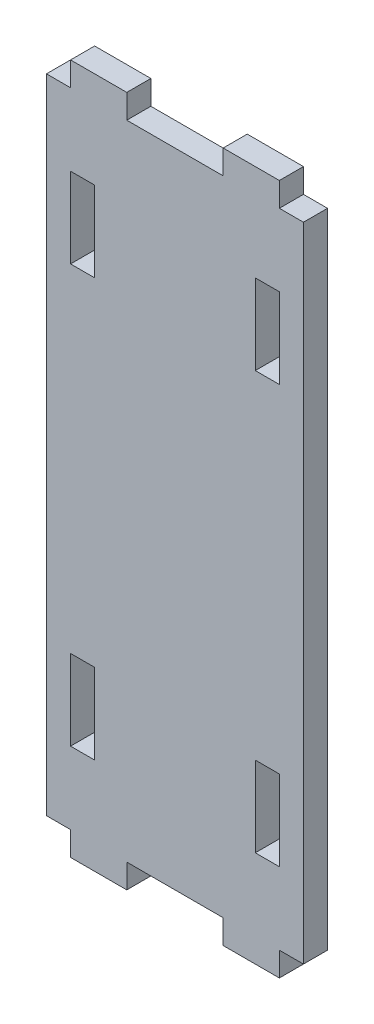
ISO-10303-21;
HEADER;
FILE_DESCRIPTION(('STEP AP214'),'2;1');
FILE_NAME('part.step','',(''),(''),'','','');
FILE_SCHEMA(('AUTOMOTIVE_DESIGN { 1 0 10303 214 1 1 1 1 }'));
ENDSEC;
DATA;
#1=APPLICATION_CONTEXT('core data for automotive mechanical design processes');
#2=APPLICATION_PROTOCOL_DEFINITION('international standard','automotive_design',2000,#1);
#3=PRODUCT_CONTEXT('',#1,'mechanical');
#4=PRODUCT('Part','Part','',(#3));
#5=PRODUCT_RELATED_PRODUCT_CATEGORY('part','',(#4));
#6=PRODUCT_DEFINITION_FORMATION('','',#4);
#7=PRODUCT_DEFINITION_CONTEXT('part definition',#1,'design');
#8=PRODUCT_DEFINITION('design','',#6,#7);
#9=PRODUCT_DEFINITION_SHAPE('','',#8);
#10=(LENGTH_UNIT() NAMED_UNIT(*) SI_UNIT(.MILLI.,.METRE.));
#11=(NAMED_UNIT(*) PLANE_ANGLE_UNIT() SI_UNIT($,.RADIAN.));
#12=(NAMED_UNIT(*) SI_UNIT($,.STERADIAN.) SOLID_ANGLE_UNIT());
#13=UNCERTAINTY_MEASURE_WITH_UNIT(LENGTH_MEASURE(1.E-05),#10,'distance_accuracy_value','');
#14=(GEOMETRIC_REPRESENTATION_CONTEXT(3) GLOBAL_UNCERTAINTY_ASSIGNED_CONTEXT((#13)) GLOBAL_UNIT_ASSIGNED_CONTEXT((#10,
#11,#12)) REPRESENTATION_CONTEXT('',''));
#15=CARTESIAN_POINT('',(0.,0.,0.));
#16=DIRECTION('',(0.,0.,1.));
#17=DIRECTION('',(1.,0.,0.));
#18=AXIS2_PLACEMENT_3D('',#15,#16,#17);
#19=CARTESIAN_POINT('',(0.,0.,3.));
#20=DIRECTION('',(1.,0.,0.));
#21=DIRECTION('',(0.,0.,-1.));
#22=AXIS2_PLACEMENT_3D('',#19,#20,#21);
#23=PLANE('',#22);
#24=DIRECTION('',(0.,-1.,0.));
#25=VECTOR('',#24,1.);
#26=CARTESIAN_POINT('',(0.,0.,3.));
#27=LINE('',#26,#25);
#28=CARTESIAN_POINT('',(0.,83.,3.));
#29=VERTEX_POINT('',#28);
#30=CARTESIAN_POINT('',(0.,3.,3.));
#31=VERTEX_POINT('',#30);
#32=EDGE_CURVE('E522',#29,#31,#27,.T.);
#33=ORIENTED_EDGE('',*,*,#32,.F.);
#34=DIRECTION('',(0.,0.,1.));
#35=VECTOR('',#34,1.);
#36=CARTESIAN_POINT('',(0.,83.,0.));
#37=LINE('',#36,#35);
#38=CARTESIAN_POINT('',(0.,83.,0.));
#39=VERTEX_POINT('',#38);
#40=EDGE_CURVE('E428',#39,#29,#37,.T.);
#41=ORIENTED_EDGE('',*,*,#40,.F.);
#42=DIRECTION('',(0.,-1.,0.));
#43=VECTOR('',#42,1.);
#44=CARTESIAN_POINT('',(0.,0.,0.));
#45=LINE('',#44,#43);
#46=CARTESIAN_POINT('',(0.,3.,0.));
#47=VERTEX_POINT('',#46);
#48=EDGE_CURVE('E515',#39,#47,#45,.T.);
#49=ORIENTED_EDGE('',*,*,#48,.T.);
#50=DIRECTION('',(0.,0.,1.));
#51=VECTOR('',#50,1.);
#52=CARTESIAN_POINT('',(0.,3.,0.));
#53=LINE('',#52,#51);
#54=EDGE_CURVE('E493',#47,#31,#53,.T.);
#55=ORIENTED_EDGE('',*,*,#54,.T.);
#56=EDGE_LOOP('',(#33,#41,#49,#55));
#57=FACE_BOUND('',#56,.T.);
#58=ADVANCED_FACE('F34',(#57),#23,.F.);
#59=CARTESIAN_POINT('',(0.,0.,3.));
#60=DIRECTION('',(0.,1.,0.));
#61=DIRECTION('',(0.,0.,1.));
#62=AXIS2_PLACEMENT_3D('',#59,#60,#61);
#63=PLANE('',#62);
#64=DIRECTION('',(0.,0.,1.));
#65=VECTOR('',#64,1.);
#66=CARTESIAN_POINT('',(22.,0.,0.));
#67=LINE('',#66,#65);
#68=CARTESIAN_POINT('',(22.,0.,0.));
#69=VERTEX_POINT('',#68);
#70=CARTESIAN_POINT('',(22.,0.,3.));
#71=VERTEX_POINT('',#70);
#72=EDGE_CURVE('E451',#69,#71,#67,.T.);
#73=ORIENTED_EDGE('',*,*,#72,.F.);
#74=DIRECTION('',(1.,0.,0.));
#75=VECTOR('',#74,1.);
#76=CARTESIAN_POINT('',(0.,0.,0.));
#77=LINE('',#76,#75);
#78=CARTESIAN_POINT('',(29.,0.,0.));
#79=VERTEX_POINT('',#78);
#80=EDGE_CURVE('E536',#69,#79,#77,.T.);
#81=ORIENTED_EDGE('',*,*,#80,.T.);
#82=DIRECTION('',(0.,0.,1.));
#83=VECTOR('',#82,1.);
#84=CARTESIAN_POINT('',(29.,0.,0.));
#85=LINE('',#84,#83);
#86=CARTESIAN_POINT('',(29.,0.,3.));
#87=VERTEX_POINT('',#86);
#88=EDGE_CURVE('E417',#79,#87,#85,.T.);
#89=ORIENTED_EDGE('',*,*,#88,.T.);
#90=DIRECTION('',(1.,0.,0.));
#91=VECTOR('',#90,1.);
#92=CARTESIAN_POINT('',(0.,0.,3.));
#93=LINE('',#92,#91);
#94=EDGE_CURVE('E525',#71,#87,#93,.T.);
#95=ORIENTED_EDGE('',*,*,#94,.F.);
#96=EDGE_LOOP('',(#73,#81,#89,#95));
#97=FACE_BOUND('',#96,.T.);
#98=ADVANCED_FACE('F630',(#97),#63,.F.);
#99=CARTESIAN_POINT('',(3.,0.,0.));
#100=VERTEX_POINT('',#99);
#101=CARTESIAN_POINT('',(10.,0.,0.));
#102=VERTEX_POINT('',#101);
#103=EDGE_CURVE('E538',#100,#102,#77,.T.);
#104=ORIENTED_EDGE('',*,*,#103,.T.);
#105=DIRECTION('',(0.,0.,1.));
#106=VECTOR('',#105,1.);
#107=CARTESIAN_POINT('',(10.,0.,0.));
#108=LINE('',#107,#106);
#109=CARTESIAN_POINT('',(10.,0.,3.));
#110=VERTEX_POINT('',#109);
#111=EDGE_CURVE('E476',#102,#110,#108,.T.);
#112=ORIENTED_EDGE('',*,*,#111,.T.);
#113=CARTESIAN_POINT('',(3.,0.,3.));
#114=VERTEX_POINT('',#113);
#115=EDGE_CURVE('E529',#114,#110,#93,.T.);
#116=ORIENTED_EDGE('',*,*,#115,.F.);
#117=DIRECTION('',(0.,0.,1.));
#118=VECTOR('',#117,1.);
#119=CARTESIAN_POINT('',(3.,0.,0.));
#120=LINE('',#119,#118);
#121=EDGE_CURVE('E471',#100,#114,#120,.T.);
#122=ORIENTED_EDGE('',*,*,#121,.F.);
#123=EDGE_LOOP('',(#104,#112,#116,#122));
#124=FACE_BOUND('',#123,.T.);
#125=ADVANCED_FACE('F549',(#124),#63,.F.);
#126=CARTESIAN_POINT('',(32.,0.,3.));
#127=DIRECTION('',(-1.,0.,0.));
#128=DIRECTION('',(0.,0.,1.));
#129=AXIS2_PLACEMENT_3D('',#126,#127,#128);
#130=PLANE('',#129);
#131=DIRECTION('',(0.,1.,0.));
#132=VECTOR('',#131,1.);
#133=CARTESIAN_POINT('',(32.,0.,0.));
#134=LINE('',#133,#132);
#135=CARTESIAN_POINT('',(32.,3.,0.));
#136=VERTEX_POINT('',#135);
#137=CARTESIAN_POINT('',(32.,83.,0.));
#138=VERTEX_POINT('',#137);
#139=EDGE_CURVE('E539',#136,#138,#134,.T.);
#140=ORIENTED_EDGE('',*,*,#139,.T.);
#141=DIRECTION('',(0.,0.,1.));
#142=VECTOR('',#141,1.);
#143=CARTESIAN_POINT('',(32.,83.,0.));
#144=LINE('',#143,#142);
#145=CARTESIAN_POINT('',(32.,83.,3.));
#146=VERTEX_POINT('',#145);
#147=EDGE_CURVE('E454',#138,#146,#144,.T.);
#148=ORIENTED_EDGE('',*,*,#147,.T.);
#149=DIRECTION('',(0.,1.,0.));
#150=VECTOR('',#149,1.);
#151=CARTESIAN_POINT('',(32.,0.,3.));
#152=LINE('',#151,#150);
#153=CARTESIAN_POINT('',(32.,3.,3.));
#154=VERTEX_POINT('',#153);
#155=EDGE_CURVE('E530',#154,#146,#152,.T.);
#156=ORIENTED_EDGE('',*,*,#155,.F.);
#157=DIRECTION('',(0.,0.,1.));
#158=VECTOR('',#157,1.);
#159=CARTESIAN_POINT('',(32.,3.,0.));
#160=LINE('',#159,#158);
#161=EDGE_CURVE('E414',#136,#154,#160,.T.);
#162=ORIENTED_EDGE('',*,*,#161,.F.);
#163=EDGE_LOOP('',(#140,#148,#156,#162));
#164=FACE_BOUND('',#163,.T.);
#165=ADVANCED_FACE('F617',(#164),#130,.F.);
#166=CARTESIAN_POINT('',(0.,86.,3.));
#167=DIRECTION('',(0.,-1.,0.));
#168=DIRECTION('',(0.,0.,-1.));
#169=AXIS2_PLACEMENT_3D('',#166,#167,#168);
#170=PLANE('',#169);
#171=DIRECTION('',(0.,0.,1.));
#172=VECTOR('',#171,1.);
#173=CARTESIAN_POINT('',(29.,86.,0.));
#174=LINE('',#173,#172);
#175=CARTESIAN_POINT('',(29.,86.,0.));
#176=VERTEX_POINT('',#175);
#177=CARTESIAN_POINT('',(29.,86.,3.));
#178=VERTEX_POINT('',#177);
#179=EDGE_CURVE('E432',#176,#178,#174,.T.);
#180=ORIENTED_EDGE('',*,*,#179,.F.);
#181=DIRECTION('',(-1.,0.,0.));
#182=VECTOR('',#181,1.);
#183=CARTESIAN_POINT('',(0.,86.,0.));
#184=LINE('',#183,#182);
#185=CARTESIAN_POINT('',(22.,86.,0.));
#186=VERTEX_POINT('',#185);
#187=EDGE_CURVE('E526',#176,#186,#184,.T.);
#188=ORIENTED_EDGE('',*,*,#187,.T.);
#189=DIRECTION('',(0.,0.,1.));
#190=VECTOR('',#189,1.);
#191=CARTESIAN_POINT('',(22.,86.,0.));
#192=LINE('',#191,#190);
#193=CARTESIAN_POINT('',(22.,86.,3.));
#194=VERTEX_POINT('',#193);
#195=EDGE_CURVE('E516',#186,#194,#192,.T.);
#196=ORIENTED_EDGE('',*,*,#195,.T.);
#197=DIRECTION('',(-1.,0.,0.));
#198=VECTOR('',#197,1.);
#199=CARTESIAN_POINT('',(0.,86.,3.));
#200=LINE('',#199,#198);
#201=EDGE_CURVE('E12',#178,#194,#200,.T.);
#202=ORIENTED_EDGE('',*,*,#201,.F.);
#203=EDGE_LOOP('',(#180,#188,#196,#202));
#204=FACE_BOUND('',#203,.T.);
#205=ADVANCED_FACE('F607',(#204),#170,.F.);
#206=CARTESIAN_POINT('',(10.,86.,0.));
#207=VERTEX_POINT('',#206);
#208=CARTESIAN_POINT('',(3.,86.,0.));
#209=VERTEX_POINT('',#208);
#210=EDGE_CURVE('E37',#207,#209,#184,.T.);
#211=ORIENTED_EDGE('',*,*,#210,.T.);
#212=DIRECTION('',(0.,0.,1.));
#213=VECTOR('',#212,1.);
#214=CARTESIAN_POINT('',(3.,86.,0.));
#215=LINE('',#214,#213);
#216=CARTESIAN_POINT('',(3.,86.,3.));
#217=VERTEX_POINT('',#216);
#218=EDGE_CURVE('E434',#209,#217,#215,.T.);
#219=ORIENTED_EDGE('',*,*,#218,.T.);
#220=CARTESIAN_POINT('',(10.,86.,3.));
#221=VERTEX_POINT('',#220);
#222=EDGE_CURVE('E42',#221,#217,#200,.T.);
#223=ORIENTED_EDGE('',*,*,#222,.F.);
#224=DIRECTION('',(0.,0.,1.));
#225=VECTOR('',#224,1.);
#226=CARTESIAN_POINT('',(10.,86.,0.));
#227=LINE('',#226,#225);
#228=EDGE_CURVE('E513',#207,#221,#227,.T.);
#229=ORIENTED_EDGE('',*,*,#228,.F.);
#230=EDGE_LOOP('',(#211,#219,#223,#229));
#231=FACE_BOUND('',#230,.T.);
#232=ADVANCED_FACE('F587',(#231),#170,.F.);
#233=CARTESIAN_POINT('',(0.,0.,3.));
#234=DIRECTION('',(0.,0.,-1.));
#235=DIRECTION('',(-1.,0.,0.));
#236=AXIS2_PLACEMENT_3D('',#233,#234,#235);
#237=PLANE('',#236);
#238=DIRECTION('',(1.,0.,0.));
#239=VECTOR('',#238,1.);
#240=CARTESIAN_POINT('',(3.,64.,3.));
#241=LINE('',#240,#239);
#242=CARTESIAN_POINT('',(3.,64.,3.));
#243=VERTEX_POINT('',#242);
#244=CARTESIAN_POINT('',(6.,64.,3.));
#245=VERTEX_POINT('',#244);
#246=EDGE_CURVE('E326',#243,#245,#241,.T.);
#247=ORIENTED_EDGE('',*,*,#246,.F.);
#248=DIRECTION('',(0.,-1.,0.));
#249=VECTOR('',#248,1.);
#250=CARTESIAN_POINT('',(3.,74.,3.));
#251=LINE('',#250,#249);
#252=CARTESIAN_POINT('',(3.,74.,3.));
#253=VERTEX_POINT('',#252);
#254=EDGE_CURVE('E50',#253,#243,#251,.T.);
#255=ORIENTED_EDGE('',*,*,#254,.F.);
#256=DIRECTION('',(-1.,0.,0.));
#257=VECTOR('',#256,1.);
#258=CARTESIAN_POINT('',(3.,74.,3.));
#259=LINE('',#258,#257);
#260=CARTESIAN_POINT('',(6.,74.,3.));
#261=VERTEX_POINT('',#260);
#262=EDGE_CURVE('E315',#261,#253,#259,.T.);
#263=ORIENTED_EDGE('',*,*,#262,.F.);
#264=DIRECTION('',(0.,1.,0.));
#265=VECTOR('',#264,1.);
#266=CARTESIAN_POINT('',(6.,74.,3.));
#267=LINE('',#266,#265);
#268=EDGE_CURVE('E330',#245,#261,#267,.T.);
#269=ORIENTED_EDGE('',*,*,#268,.F.);
#270=EDGE_LOOP('',(#247,#255,#263,#269));
#271=FACE_BOUND('',#270,.T.);
#272=DIRECTION('',(-1.,0.,0.));
#273=VECTOR('',#272,1.);
#274=CARTESIAN_POINT('',(29.,22.,3.));
#275=LINE('',#274,#273);
#276=CARTESIAN_POINT('',(29.,22.,3.));
#277=VERTEX_POINT('',#276);
#278=CARTESIAN_POINT('',(26.,22.,3.));
#279=VERTEX_POINT('',#278);
#280=EDGE_CURVE('E358',#277,#279,#275,.T.);
#281=ORIENTED_EDGE('',*,*,#280,.F.);
#282=DIRECTION('',(0.,1.,0.));
#283=VECTOR('',#282,1.);
#284=CARTESIAN_POINT('',(29.,12.,3.));
#285=LINE('',#284,#283);
#286=CARTESIAN_POINT('',(29.,12.,3.));
#287=VERTEX_POINT('',#286);
#288=EDGE_CURVE('E58',#287,#277,#285,.T.);
#289=ORIENTED_EDGE('',*,*,#288,.F.);
#290=DIRECTION('',(1.,0.,0.));
#291=VECTOR('',#290,1.);
#292=CARTESIAN_POINT('',(29.,12.,3.));
#293=LINE('',#292,#291);
#294=CARTESIAN_POINT('',(26.,12.,3.));
#295=VERTEX_POINT('',#294);
#296=EDGE_CURVE('E347',#295,#287,#293,.T.);
#297=ORIENTED_EDGE('',*,*,#296,.F.);
#298=DIRECTION('',(0.,-1.,0.));
#299=VECTOR('',#298,1.);
#300=CARTESIAN_POINT('',(26.,12.,3.));
#301=LINE('',#300,#299);
#302=EDGE_CURVE('E361',#279,#295,#301,.T.);
#303=ORIENTED_EDGE('',*,*,#302,.F.);
#304=EDGE_LOOP('',(#281,#289,#297,#303));
#305=FACE_BOUND('',#304,.T.);
#306=DIRECTION('',(0.,1.,0.));
#307=VECTOR('',#306,1.);
#308=CARTESIAN_POINT('',(6.,12.,3.));
#309=LINE('',#308,#307);
#310=CARTESIAN_POINT('',(6.,12.,3.));
#311=VERTEX_POINT('',#310);
#312=CARTESIAN_POINT('',(6.,22.,3.));
#313=VERTEX_POINT('',#312);
#314=EDGE_CURVE('E302',#311,#313,#309,.T.);
#315=ORIENTED_EDGE('',*,*,#314,.F.);
#316=DIRECTION('',(1.,0.,0.));
#317=VECTOR('',#316,1.);
#318=CARTESIAN_POINT('',(3.,12.,3.));
#319=LINE('',#318,#317);
#320=CARTESIAN_POINT('',(3.,12.,3.));
#321=VERTEX_POINT('',#320);
#322=EDGE_CURVE('E275',#321,#311,#319,.T.);
#323=ORIENTED_EDGE('',*,*,#322,.F.);
#324=DIRECTION('',(0.,-1.,0.));
#325=VECTOR('',#324,1.);
#326=CARTESIAN_POINT('',(3.,12.,3.));
#327=LINE('',#326,#325);
#328=CARTESIAN_POINT('',(3.,22.,3.));
#329=VERTEX_POINT('',#328);
#330=EDGE_CURVE('E293',#329,#321,#327,.T.);
#331=ORIENTED_EDGE('',*,*,#330,.F.);
#332=DIRECTION('',(-1.,0.,0.));
#333=VECTOR('',#332,1.);
#334=CARTESIAN_POINT('',(3.,22.,3.));
#335=LINE('',#334,#333);
#336=EDGE_CURVE('E296',#313,#329,#335,.T.);
#337=ORIENTED_EDGE('',*,*,#336,.F.);
#338=EDGE_LOOP('',(#315,#323,#331,#337));
#339=FACE_BOUND('',#338,.T.);
#340=DIRECTION('',(-1.,0.,0.));
#341=VECTOR('',#340,1.);
#342=CARTESIAN_POINT('',(29.,74.,3.));
#343=LINE('',#342,#341);
#344=CARTESIAN_POINT('',(29.,74.,3.));
#345=VERTEX_POINT('',#344);
#346=CARTESIAN_POINT('',(26.,74.,3.));
#347=VERTEX_POINT('',#346);
#348=EDGE_CURVE('E387',#345,#347,#343,.T.);
#349=ORIENTED_EDGE('',*,*,#348,.F.);
#350=DIRECTION('',(0.,1.,0.));
#351=VECTOR('',#350,1.);
#352=CARTESIAN_POINT('',(29.,74.,3.));
#353=LINE('',#352,#351);
#354=CARTESIAN_POINT('',(29.,64.,3.));
#355=VERTEX_POINT('',#354);
#356=EDGE_CURVE('E337',#355,#345,#353,.T.);
#357=ORIENTED_EDGE('',*,*,#356,.F.);
#358=DIRECTION('',(1.,0.,0.));
#359=VECTOR('',#358,1.);
#360=CARTESIAN_POINT('',(29.,64.,3.));
#361=LINE('',#360,#359);
#362=CARTESIAN_POINT('',(26.,64.,3.));
#363=VERTEX_POINT('',#362);
#364=EDGE_CURVE('E376',#363,#355,#361,.T.);
#365=ORIENTED_EDGE('',*,*,#364,.F.);
#366=DIRECTION('',(0.,-1.,0.));
#367=VECTOR('',#366,1.);
#368=CARTESIAN_POINT('',(26.,74.,3.));
#369=LINE('',#368,#367);
#370=EDGE_CURVE('E390',#347,#363,#369,.T.);
#371=ORIENTED_EDGE('',*,*,#370,.F.);
#372=EDGE_LOOP('',(#349,#357,#365,#371));
#373=FACE_BOUND('',#372,.T.);
#374=ORIENTED_EDGE('',*,*,#222,.T.);
#375=DIRECTION('',(0.,1.,0.));
#376=VECTOR('',#375,1.);
#377=CARTESIAN_POINT('',(2.99999999999999,0.,3.));
#378=LINE('',#377,#376);
#379=CARTESIAN_POINT('',(3.,83.,3.));
#380=VERTEX_POINT('',#379);
#381=EDGE_CURVE('E425',#380,#217,#378,.T.);
#382=ORIENTED_EDGE('',*,*,#381,.F.);
#383=DIRECTION('',(1.,0.,0.));
#384=VECTOR('',#383,1.);
#385=CARTESIAN_POINT('',(0.,83.,3.));
#386=LINE('',#385,#384);
#387=EDGE_CURVE('E429',#29,#380,#386,.T.);
#388=ORIENTED_EDGE('',*,*,#387,.F.);
#389=ORIENTED_EDGE('',*,*,#32,.T.);
#390=DIRECTION('',(1.,0.,0.));
#391=VECTOR('',#390,1.);
#392=CARTESIAN_POINT('',(0.,3.,3.));
#393=LINE('',#392,#391);
#394=CARTESIAN_POINT('',(3.,3.,3.));
#395=VERTEX_POINT('',#394);
#396=EDGE_CURVE('E485',#31,#395,#393,.T.);
#397=ORIENTED_EDGE('',*,*,#396,.T.);
#398=DIRECTION('',(0.,-1.,0.));
#399=VECTOR('',#398,1.);
#400=CARTESIAN_POINT('',(3.,0.,3.));
#401=LINE('',#400,#399);
#402=EDGE_CURVE('E416',#395,#114,#401,.T.);
#403=ORIENTED_EDGE('',*,*,#402,.T.);
#404=ORIENTED_EDGE('',*,*,#115,.T.);
#405=DIRECTION('',(0.,-1.,0.));
#406=VECTOR('',#405,1.);
#407=CARTESIAN_POINT('',(10.,0.,3.));
#408=LINE('',#407,#406);
#409=CARTESIAN_POINT('',(10.,3.,3.));
#410=VERTEX_POINT('',#409);
#411=EDGE_CURVE('E461',#410,#110,#408,.T.);
#412=ORIENTED_EDGE('',*,*,#411,.F.);
#413=DIRECTION('',(1.,0.,0.));
#414=VECTOR('',#413,1.);
#415=CARTESIAN_POINT('',(0.,3.,3.));
#416=LINE('',#415,#414);
#417=CARTESIAN_POINT('',(22.,3.,3.));
#418=VERTEX_POINT('',#417);
#419=EDGE_CURVE('E470',#410,#418,#416,.T.);
#420=ORIENTED_EDGE('',*,*,#419,.T.);
#421=DIRECTION('',(0.,-1.,0.));
#422=VECTOR('',#421,1.);
#423=CARTESIAN_POINT('',(22.,0.,3.));
#424=LINE('',#423,#422);
#425=EDGE_CURVE('E467',#418,#71,#424,.T.);
#426=ORIENTED_EDGE('',*,*,#425,.T.);
#427=ORIENTED_EDGE('',*,*,#94,.T.);
#428=DIRECTION('',(0.,-1.,0.));
#429=VECTOR('',#428,1.);
#430=CARTESIAN_POINT('',(29.,0.,3.));
#431=LINE('',#430,#429);
#432=CARTESIAN_POINT('',(29.,3.,3.));
#433=VERTEX_POINT('',#432);
#434=EDGE_CURVE('E407',#433,#87,#431,.T.);
#435=ORIENTED_EDGE('',*,*,#434,.F.);
#436=DIRECTION('',(1.,0.,0.));
#437=VECTOR('',#436,1.);
#438=CARTESIAN_POINT('',(0.,3.,3.));
#439=LINE('',#438,#437);
#440=EDGE_CURVE('E397',#433,#154,#439,.T.);
#441=ORIENTED_EDGE('',*,*,#440,.T.);
#442=ORIENTED_EDGE('',*,*,#155,.T.);
#443=DIRECTION('',(1.,0.,0.));
#444=VECTOR('',#443,1.);
#445=CARTESIAN_POINT('',(0.,83.,3.));
#446=LINE('',#445,#444);
#447=CARTESIAN_POINT('',(29.,83.,3.));
#448=VERTEX_POINT('',#447);
#449=EDGE_CURVE('E444',#448,#146,#446,.T.);
#450=ORIENTED_EDGE('',*,*,#449,.F.);
#451=DIRECTION('',(0.,1.,0.));
#452=VECTOR('',#451,1.);
#453=CARTESIAN_POINT('',(29.,0.,3.));
#454=LINE('',#453,#452);
#455=EDGE_CURVE('E448',#448,#178,#454,.T.);
#456=ORIENTED_EDGE('',*,*,#455,.T.);
#457=ORIENTED_EDGE('',*,*,#201,.T.);
#458=DIRECTION('',(0.,1.,0.));
#459=VECTOR('',#458,1.);
#460=CARTESIAN_POINT('',(22.,0.,3.));
#461=LINE('',#460,#459);
#462=CARTESIAN_POINT('',(22.,83.,3.));
#463=VERTEX_POINT('',#462);
#464=EDGE_CURVE('E500',#463,#194,#461,.T.);
#465=ORIENTED_EDGE('',*,*,#464,.F.);
#466=DIRECTION('',(1.,0.,0.));
#467=VECTOR('',#466,1.);
#468=CARTESIAN_POINT('',(0.,83.,3.));
#469=LINE('',#468,#467);
#470=CARTESIAN_POINT('',(10.,83.,3.));
#471=VERTEX_POINT('',#470);
#472=EDGE_CURVE('E509',#471,#463,#469,.T.);
#473=ORIENTED_EDGE('',*,*,#472,.F.);
#474=DIRECTION('',(0.,1.,0.));
#475=VECTOR('',#474,1.);
#476=CARTESIAN_POINT('',(10.,0.,3.));
#477=LINE('',#476,#475);
#478=EDGE_CURVE('E437',#471,#221,#477,.T.);
#479=ORIENTED_EDGE('',*,*,#478,.T.);
#480=EDGE_LOOP('',(#374,#382,#388,#389,#397,#403,#404,#412,#420,#426,#427,#435,#441,#442,#450,
#456,#457,#465,#473,#479));
#481=FACE_BOUND('',#480,.T.);
#482=ADVANCED_FACE('F567',(#271,#305,#339,#373,#481),#237,.F.);
#483=CARTESIAN_POINT('',(0.,0.,0.));
#484=DIRECTION('',(0.,0.,-1.));
#485=DIRECTION('',(-1.,0.,0.));
#486=AXIS2_PLACEMENT_3D('',#483,#484,#485);
#487=PLANE('',#486);
#488=DIRECTION('',(0.,-1.,0.));
#489=VECTOR('',#488,1.);
#490=CARTESIAN_POINT('',(3.,74.,0.));
#491=LINE('',#490,#489);
#492=CARTESIAN_POINT('',(3.,74.,0.));
#493=VERTEX_POINT('',#492);
#494=CARTESIAN_POINT('',(3.,64.,0.));
#495=VERTEX_POINT('',#494);
#496=EDGE_CURVE('E311',#493,#495,#491,.T.);
#497=ORIENTED_EDGE('',*,*,#496,.T.);
#498=DIRECTION('',(1.,0.,0.));
#499=VECTOR('',#498,1.);
#500=CARTESIAN_POINT('',(3.,64.,0.));
#501=LINE('',#500,#499);
#502=CARTESIAN_POINT('',(6.,64.,0.));
#503=VERTEX_POINT('',#502);
#504=EDGE_CURVE('E314',#495,#503,#501,.T.);
#505=ORIENTED_EDGE('',*,*,#504,.T.);
#506=DIRECTION('',(0.,1.,0.));
#507=VECTOR('',#506,1.);
#508=CARTESIAN_POINT('',(6.,74.,0.));
#509=LINE('',#508,#507);
#510=CARTESIAN_POINT('',(6.,74.,0.));
#511=VERTEX_POINT('',#510);
#512=EDGE_CURVE('E318',#503,#511,#509,.T.);
#513=ORIENTED_EDGE('',*,*,#512,.T.);
#514=DIRECTION('',(-1.,0.,0.));
#515=VECTOR('',#514,1.);
#516=CARTESIAN_POINT('',(3.,74.,0.));
#517=LINE('',#516,#515);
#518=EDGE_CURVE('E321',#511,#493,#517,.T.);
#519=ORIENTED_EDGE('',*,*,#518,.T.);
#520=EDGE_LOOP('',(#497,#505,#513,#519));
#521=FACE_BOUND('',#520,.T.);
#522=DIRECTION('',(0.,1.,0.));
#523=VECTOR('',#522,1.);
#524=CARTESIAN_POINT('',(29.,12.,0.));
#525=LINE('',#524,#523);
#526=CARTESIAN_POINT('',(29.,12.,0.));
#527=VERTEX_POINT('',#526);
#528=CARTESIAN_POINT('',(29.,22.,0.));
#529=VERTEX_POINT('',#528);
#530=EDGE_CURVE('E343',#527,#529,#525,.T.);
#531=ORIENTED_EDGE('',*,*,#530,.T.);
#532=DIRECTION('',(-1.,0.,0.));
#533=VECTOR('',#532,1.);
#534=CARTESIAN_POINT('',(29.,22.,0.));
#535=LINE('',#534,#533);
#536=CARTESIAN_POINT('',(26.,22.,0.));
#537=VERTEX_POINT('',#536);
#538=EDGE_CURVE('E346',#529,#537,#535,.T.);
#539=ORIENTED_EDGE('',*,*,#538,.T.);
#540=DIRECTION('',(0.,-1.,0.));
#541=VECTOR('',#540,1.);
#542=CARTESIAN_POINT('',(26.,12.,0.));
#543=LINE('',#542,#541);
#544=CARTESIAN_POINT('',(26.,12.,0.));
#545=VERTEX_POINT('',#544);
#546=EDGE_CURVE('E350',#537,#545,#543,.T.);
#547=ORIENTED_EDGE('',*,*,#546,.T.);
#548=DIRECTION('',(1.,0.,0.));
#549=VECTOR('',#548,1.);
#550=CARTESIAN_POINT('',(29.,12.,0.));
#551=LINE('',#550,#549);
#552=EDGE_CURVE('E353',#545,#527,#551,.T.);
#553=ORIENTED_EDGE('',*,*,#552,.T.);
#554=EDGE_LOOP('',(#531,#539,#547,#553));
#555=FACE_BOUND('',#554,.T.);
#556=DIRECTION('',(1.,0.,0.));
#557=VECTOR('',#556,1.);
#558=CARTESIAN_POINT('',(3.,12.,0.));
#559=LINE('',#558,#557);
#560=CARTESIAN_POINT('',(3.,12.,0.));
#561=VERTEX_POINT('',#560);
#562=CARTESIAN_POINT('',(6.,12.,0.));
#563=VERTEX_POINT('',#562);
#564=EDGE_CURVE('E272',#561,#563,#559,.T.);
#565=ORIENTED_EDGE('',*,*,#564,.T.);
#566=DIRECTION('',(0.,1.,0.));
#567=VECTOR('',#566,1.);
#568=CARTESIAN_POINT('',(6.,12.,0.));
#569=LINE('',#568,#567);
#570=CARTESIAN_POINT('',(6.,22.,0.));
#571=VERTEX_POINT('',#570);
#572=EDGE_CURVE('E284',#563,#571,#569,.T.);
#573=ORIENTED_EDGE('',*,*,#572,.T.);
#574=DIRECTION('',(-1.,0.,0.));
#575=VECTOR('',#574,1.);
#576=CARTESIAN_POINT('',(3.,22.,0.));
#577=LINE('',#576,#575);
#578=CARTESIAN_POINT('',(3.,22.,0.));
#579=VERTEX_POINT('',#578);
#580=EDGE_CURVE('E288',#571,#579,#577,.T.);
#581=ORIENTED_EDGE('',*,*,#580,.T.);
#582=DIRECTION('',(0.,-1.,0.));
#583=VECTOR('',#582,1.);
#584=CARTESIAN_POINT('',(3.,12.,0.));
#585=LINE('',#584,#583);
#586=EDGE_CURVE('E280',#579,#561,#585,.T.);
#587=ORIENTED_EDGE('',*,*,#586,.T.);
#588=EDGE_LOOP('',(#565,#573,#581,#587));
#589=FACE_BOUND('',#588,.T.);
#590=DIRECTION('',(0.,1.,0.));
#591=VECTOR('',#590,1.);
#592=CARTESIAN_POINT('',(29.,74.,0.));
#593=LINE('',#592,#591);
#594=CARTESIAN_POINT('',(29.,64.,0.));
#595=VERTEX_POINT('',#594);
#596=CARTESIAN_POINT('',(29.,74.,0.));
#597=VERTEX_POINT('',#596);
#598=EDGE_CURVE('E372',#595,#597,#593,.T.);
#599=ORIENTED_EDGE('',*,*,#598,.T.);
#600=DIRECTION('',(-1.,0.,0.));
#601=VECTOR('',#600,1.);
#602=CARTESIAN_POINT('',(29.,74.,0.));
#603=LINE('',#602,#601);
#604=CARTESIAN_POINT('',(26.,74.,0.));
#605=VERTEX_POINT('',#604);
#606=EDGE_CURVE('E375',#597,#605,#603,.T.);
#607=ORIENTED_EDGE('',*,*,#606,.T.);
#608=DIRECTION('',(0.,-1.,0.));
#609=VECTOR('',#608,1.);
#610=CARTESIAN_POINT('',(26.,74.,0.));
#611=LINE('',#610,#609);
#612=CARTESIAN_POINT('',(26.,64.,0.));
#613=VERTEX_POINT('',#612);
#614=EDGE_CURVE('E379',#605,#613,#611,.T.);
#615=ORIENTED_EDGE('',*,*,#614,.T.);
#616=DIRECTION('',(1.,0.,0.));
#617=VECTOR('',#616,1.);
#618=CARTESIAN_POINT('',(29.,64.,0.));
#619=LINE('',#618,#617);
#620=EDGE_CURVE('E382',#613,#595,#619,.T.);
#621=ORIENTED_EDGE('',*,*,#620,.T.);
#622=EDGE_LOOP('',(#599,#607,#615,#621));
#623=FACE_BOUND('',#622,.T.);
#624=DIRECTION('',(0.,1.,0.));
#625=VECTOR('',#624,1.);
#626=CARTESIAN_POINT('',(2.99999999999999,0.,0.));
#627=LINE('',#626,#625);
#628=CARTESIAN_POINT('',(3.,83.,0.));
#629=VERTEX_POINT('',#628);
#630=EDGE_CURVE('E424',#629,#209,#627,.T.);
#631=ORIENTED_EDGE('',*,*,#630,.T.);
#632=ORIENTED_EDGE('',*,*,#210,.F.);
#633=DIRECTION('',(0.,1.,0.));
#634=VECTOR('',#633,1.);
#635=CARTESIAN_POINT('',(10.,0.,0.));
#636=LINE('',#635,#634);
#637=CARTESIAN_POINT('',(10.,83.,0.));
#638=VERTEX_POINT('',#637);
#639=EDGE_CURVE('E497',#638,#207,#636,.T.);
#640=ORIENTED_EDGE('',*,*,#639,.F.);
#641=DIRECTION('',(1.,0.,0.));
#642=VECTOR('',#641,1.);
#643=CARTESIAN_POINT('',(0.,83.,0.));
#644=LINE('',#643,#642);
#645=CARTESIAN_POINT('',(22.,83.,0.));
#646=VERTEX_POINT('',#645);
#647=EDGE_CURVE('E499',#638,#646,#644,.T.);
#648=ORIENTED_EDGE('',*,*,#647,.T.);
#649=DIRECTION('',(0.,1.,0.));
#650=VECTOR('',#649,1.);
#651=CARTESIAN_POINT('',(22.,0.,0.));
#652=LINE('',#651,#650);
#653=EDGE_CURVE('E503',#646,#186,#652,.T.);
#654=ORIENTED_EDGE('',*,*,#653,.T.);
#655=ORIENTED_EDGE('',*,*,#187,.F.);
#656=DIRECTION('',(0.,1.,0.));
#657=VECTOR('',#656,1.);
#658=CARTESIAN_POINT('',(29.,0.,0.));
#659=LINE('',#658,#657);
#660=CARTESIAN_POINT('',(29.,83.,0.));
#661=VERTEX_POINT('',#660);
#662=EDGE_CURVE('E441',#661,#176,#659,.T.);
#663=ORIENTED_EDGE('',*,*,#662,.F.);
#664=DIRECTION('',(1.,0.,0.));
#665=VECTOR('',#664,1.);
#666=CARTESIAN_POINT('',(0.,83.,0.));
#667=LINE('',#666,#665);
#668=EDGE_CURVE('E443',#661,#138,#667,.T.);
#669=ORIENTED_EDGE('',*,*,#668,.T.);
#670=ORIENTED_EDGE('',*,*,#139,.F.);
#671=DIRECTION('',(1.,0.,0.));
#672=VECTOR('',#671,1.);
#673=CARTESIAN_POINT('',(0.,3.,0.));
#674=LINE('',#673,#672);
#675=CARTESIAN_POINT('',(29.,3.,0.));
#676=VERTEX_POINT('',#675);
#677=EDGE_CURVE('E404',#676,#136,#674,.T.);
#678=ORIENTED_EDGE('',*,*,#677,.F.);
#679=DIRECTION('',(0.,-1.,0.));
#680=VECTOR('',#679,1.);
#681=CARTESIAN_POINT('',(29.,0.,0.));
#682=LINE('',#681,#680);
#683=EDGE_CURVE('E406',#676,#79,#682,.T.);
#684=ORIENTED_EDGE('',*,*,#683,.T.);
#685=ORIENTED_EDGE('',*,*,#80,.F.);
#686=DIRECTION('',(0.,-1.,0.));
#687=VECTOR('',#686,1.);
#688=CARTESIAN_POINT('',(22.,0.,0.));
#689=LINE('',#688,#687);
#690=CARTESIAN_POINT('',(22.,3.,0.));
#691=VERTEX_POINT('',#690);
#692=EDGE_CURVE('E458',#691,#69,#689,.T.);
#693=ORIENTED_EDGE('',*,*,#692,.F.);
#694=DIRECTION('',(1.,0.,0.));
#695=VECTOR('',#694,1.);
#696=CARTESIAN_POINT('',(0.,3.,0.));
#697=LINE('',#696,#695);
#698=CARTESIAN_POINT('',(10.,3.,0.));
#699=VERTEX_POINT('',#698);
#700=EDGE_CURVE('E460',#699,#691,#697,.T.);
#701=ORIENTED_EDGE('',*,*,#700,.F.);
#702=DIRECTION('',(0.,-1.,0.));
#703=VECTOR('',#702,1.);
#704=CARTESIAN_POINT('',(10.,0.,0.));
#705=LINE('',#704,#703);
#706=EDGE_CURVE('E463',#699,#102,#705,.T.);
#707=ORIENTED_EDGE('',*,*,#706,.T.);
#708=ORIENTED_EDGE('',*,*,#103,.F.);
#709=DIRECTION('',(0.,-1.,0.));
#710=VECTOR('',#709,1.);
#711=CARTESIAN_POINT('',(3.,0.,0.));
#712=LINE('',#711,#710);
#713=CARTESIAN_POINT('',(3.,3.,0.));
#714=VERTEX_POINT('',#713);
#715=EDGE_CURVE('E482',#714,#100,#712,.T.);
#716=ORIENTED_EDGE('',*,*,#715,.F.);
#717=DIRECTION('',(1.,0.,0.));
#718=VECTOR('',#717,1.);
#719=CARTESIAN_POINT('',(0.,3.,0.));
#720=LINE('',#719,#718);
#721=EDGE_CURVE('E484',#47,#714,#720,.T.);
#722=ORIENTED_EDGE('',*,*,#721,.F.);
#723=ORIENTED_EDGE('',*,*,#48,.F.);
#724=DIRECTION('',(1.,0.,0.));
#725=VECTOR('',#724,1.);
#726=CARTESIAN_POINT('',(0.,83.,0.));
#727=LINE('',#726,#725);
#728=EDGE_CURVE('E421',#39,#629,#727,.T.);
#729=ORIENTED_EDGE('',*,*,#728,.T.);
#730=EDGE_LOOP('',(#631,#632,#640,#648,#654,#655,#663,#669,#670,#678,#684,#685,#693,#701,#707,
#708,#716,#722,#723,#729));
#731=FACE_BOUND('',#730,.T.);
#732=ADVANCED_FACE('F290',(#521,#555,#589,#623,#731),#487,.T.);
#733=CARTESIAN_POINT('',(10.,0.,0.));
#734=DIRECTION('',(1.,0.,0.));
#735=DIRECTION('',(0.,0.,-1.));
#736=AXIS2_PLACEMENT_3D('',#733,#734,#735);
#737=PLANE('',#736);
#738=ORIENTED_EDGE('',*,*,#478,.F.);
#739=DIRECTION('',(0.,0.,1.));
#740=VECTOR('',#739,1.);
#741=CARTESIAN_POINT('',(10.,83.,0.));
#742=LINE('',#741,#740);
#743=EDGE_CURVE('E506',#638,#471,#742,.T.);
#744=ORIENTED_EDGE('',*,*,#743,.F.);
#745=ORIENTED_EDGE('',*,*,#639,.T.);
#746=ORIENTED_EDGE('',*,*,#228,.T.);
#747=EDGE_LOOP('',(#738,#744,#745,#746));
#748=FACE_BOUND('',#747,.T.);
#749=ADVANCED_FACE('F594',(#748),#737,.T.);
#750=CARTESIAN_POINT('',(22.,0.,0.));
#751=DIRECTION('',(1.,0.,0.));
#752=DIRECTION('',(0.,0.,-1.));
#753=AXIS2_PLACEMENT_3D('',#750,#751,#752);
#754=PLANE('',#753);
#755=ORIENTED_EDGE('',*,*,#464,.T.);
#756=ORIENTED_EDGE('',*,*,#195,.F.);
#757=ORIENTED_EDGE('',*,*,#653,.F.);
#758=DIRECTION('',(0.,0.,1.));
#759=VECTOR('',#758,1.);
#760=CARTESIAN_POINT('',(22.,83.,0.));
#761=LINE('',#760,#759);
#762=EDGE_CURVE('E519',#646,#463,#761,.T.);
#763=ORIENTED_EDGE('',*,*,#762,.T.);
#764=EDGE_LOOP('',(#755,#756,#757,#763));
#765=FACE_BOUND('',#764,.T.);
#766=ADVANCED_FACE('F601',(#765),#754,.F.);
#767=CARTESIAN_POINT('',(0.,83.,0.));
#768=DIRECTION('',(0.,-1.,0.));
#769=DIRECTION('',(0.,0.,-1.));
#770=AXIS2_PLACEMENT_3D('',#767,#768,#769);
#771=PLANE('',#770);
#772=ORIENTED_EDGE('',*,*,#472,.T.);
#773=ORIENTED_EDGE('',*,*,#762,.F.);
#774=ORIENTED_EDGE('',*,*,#647,.F.);
#775=ORIENTED_EDGE('',*,*,#743,.T.);
#776=EDGE_LOOP('',(#772,#773,#774,#775));
#777=FACE_BOUND('',#776,.T.);
#778=ADVANCED_FACE('F598',(#777),#771,.F.);
#779=CARTESIAN_POINT('',(0.,3.,0.));
#780=DIRECTION('',(0.,-1.,0.));
#781=DIRECTION('',(0.,0.,-1.));
#782=AXIS2_PLACEMENT_3D('',#779,#780,#781);
#783=PLANE('',#782);
#784=ORIENTED_EDGE('',*,*,#440,.F.);
#785=DIRECTION('',(0.,0.,1.));
#786=VECTOR('',#785,1.);
#787=CARTESIAN_POINT('',(29.,3.,0.));
#788=LINE('',#787,#786);
#789=EDGE_CURVE('E410',#676,#433,#788,.T.);
#790=ORIENTED_EDGE('',*,*,#789,.F.);
#791=ORIENTED_EDGE('',*,*,#677,.T.);
#792=ORIENTED_EDGE('',*,*,#161,.T.);
#793=EDGE_LOOP('',(#784,#790,#791,#792));
#794=FACE_BOUND('',#793,.T.);
#795=ADVANCED_FACE('F623',(#794),#783,.T.);
#796=CARTESIAN_POINT('',(29.,0.,0.));
#797=DIRECTION('',(-1.,0.,0.));
#798=DIRECTION('',(0.,0.,1.));
#799=AXIS2_PLACEMENT_3D('',#796,#797,#798);
#800=PLANE('',#799);
#801=ORIENTED_EDGE('',*,*,#434,.T.);
#802=ORIENTED_EDGE('',*,*,#88,.F.);
#803=ORIENTED_EDGE('',*,*,#683,.F.);
#804=ORIENTED_EDGE('',*,*,#789,.T.);
#805=EDGE_LOOP('',(#801,#802,#803,#804));
#806=FACE_BOUND('',#805,.T.);
#807=ADVANCED_FACE('F626',(#806),#800,.F.);
#808=CARTESIAN_POINT('',(3.,0.,0.));
#809=DIRECTION('',(-1.,0.,0.));
#810=DIRECTION('',(0.,-1.,0.));
#811=AXIS2_PLACEMENT_3D('',#808,#809,#810);
#812=PLANE('',#811);
#813=ORIENTED_EDGE('',*,*,#402,.F.);
#814=DIRECTION('',(0.,0.,1.));
#815=VECTOR('',#814,1.);
#816=CARTESIAN_POINT('',(3.,3.,0.));
#817=LINE('',#816,#815);
#818=EDGE_CURVE('E487',#714,#395,#817,.T.);
#819=ORIENTED_EDGE('',*,*,#818,.F.);
#820=ORIENTED_EDGE('',*,*,#715,.T.);
#821=ORIENTED_EDGE('',*,*,#121,.T.);
#822=EDGE_LOOP('',(#813,#819,#820,#821));
#823=FACE_BOUND('',#822,.T.);
#824=ADVANCED_FACE('F571',(#823),#812,.T.);
#825=CARTESIAN_POINT('',(0.,3.,0.));
#826=DIRECTION('',(0.,-1.,0.));
#827=DIRECTION('',(0.,0.,-1.));
#828=AXIS2_PLACEMENT_3D('',#825,#826,#827);
#829=PLANE('',#828);
#830=ORIENTED_EDGE('',*,*,#396,.F.);
#831=ORIENTED_EDGE('',*,*,#54,.F.);
#832=ORIENTED_EDGE('',*,*,#721,.T.);
#833=ORIENTED_EDGE('',*,*,#818,.T.);
#834=EDGE_LOOP('',(#830,#831,#832,#833));
#835=FACE_BOUND('',#834,.T.);
#836=ADVANCED_FACE('F573',(#835),#829,.T.);
#837=CARTESIAN_POINT('',(22.,0.,0.));
#838=DIRECTION('',(-1.,0.,0.));
#839=DIRECTION('',(0.,0.,1.));
#840=AXIS2_PLACEMENT_3D('',#837,#838,#839);
#841=PLANE('',#840);
#842=ORIENTED_EDGE('',*,*,#425,.F.);
#843=DIRECTION('',(0.,0.,1.));
#844=VECTOR('',#843,1.);
#845=CARTESIAN_POINT('',(22.,3.,0.));
#846=LINE('',#845,#844);
#847=EDGE_CURVE('E466',#691,#418,#846,.T.);
#848=ORIENTED_EDGE('',*,*,#847,.F.);
#849=ORIENTED_EDGE('',*,*,#692,.T.);
#850=ORIENTED_EDGE('',*,*,#72,.T.);
#851=EDGE_LOOP('',(#842,#848,#849,#850));
#852=FACE_BOUND('',#851,.T.);
#853=ADVANCED_FACE('F632',(#852),#841,.T.);
#854=CARTESIAN_POINT('',(10.,0.,0.));
#855=DIRECTION('',(-1.,0.,0.));
#856=DIRECTION('',(0.,0.,1.));
#857=AXIS2_PLACEMENT_3D('',#854,#855,#856);
#858=PLANE('',#857);
#859=ORIENTED_EDGE('',*,*,#411,.T.);
#860=ORIENTED_EDGE('',*,*,#111,.F.);
#861=ORIENTED_EDGE('',*,*,#706,.F.);
#862=DIRECTION('',(0.,0.,1.));
#863=VECTOR('',#862,1.);
#864=CARTESIAN_POINT('',(10.,3.,0.));
#865=LINE('',#864,#863);
#866=EDGE_CURVE('E479',#699,#410,#865,.T.);
#867=ORIENTED_EDGE('',*,*,#866,.T.);
#868=EDGE_LOOP('',(#859,#860,#861,#867));
#869=FACE_BOUND('',#868,.T.);
#870=ADVANCED_FACE('F559',(#869),#858,.F.);
#871=CARTESIAN_POINT('',(0.,3.,0.));
#872=DIRECTION('',(0.,-1.,0.));
#873=DIRECTION('',(0.,0.,-1.));
#874=AXIS2_PLACEMENT_3D('',#871,#872,#873);
#875=PLANE('',#874);
#876=ORIENTED_EDGE('',*,*,#419,.F.);
#877=ORIENTED_EDGE('',*,*,#866,.F.);
#878=ORIENTED_EDGE('',*,*,#700,.T.);
#879=ORIENTED_EDGE('',*,*,#847,.T.);
#880=EDGE_LOOP('',(#876,#877,#878,#879));
#881=FACE_BOUND('',#880,.T.);
#882=ADVANCED_FACE('F562',(#881),#875,.T.);
#883=CARTESIAN_POINT('',(29.,0.,0.));
#884=DIRECTION('',(1.,0.,0.));
#885=DIRECTION('',(0.,0.,-1.));
#886=AXIS2_PLACEMENT_3D('',#883,#884,#885);
#887=PLANE('',#886);
#888=ORIENTED_EDGE('',*,*,#455,.F.);
#889=DIRECTION('',(0.,0.,1.));
#890=VECTOR('',#889,1.);
#891=CARTESIAN_POINT('',(29.,83.,0.));
#892=LINE('',#891,#890);
#893=EDGE_CURVE('E447',#661,#448,#892,.T.);
#894=ORIENTED_EDGE('',*,*,#893,.F.);
#895=ORIENTED_EDGE('',*,*,#662,.T.);
#896=ORIENTED_EDGE('',*,*,#179,.T.);
#897=EDGE_LOOP('',(#888,#894,#895,#896));
#898=FACE_BOUND('',#897,.T.);
#899=ADVANCED_FACE('F611',(#898),#887,.T.);
#900=CARTESIAN_POINT('',(0.,83.,0.));
#901=DIRECTION('',(0.,-1.,0.));
#902=DIRECTION('',(0.,0.,-1.));
#903=AXIS2_PLACEMENT_3D('',#900,#901,#902);
#904=PLANE('',#903);
#905=ORIENTED_EDGE('',*,*,#449,.T.);
#906=ORIENTED_EDGE('',*,*,#147,.F.);
#907=ORIENTED_EDGE('',*,*,#668,.F.);
#908=ORIENTED_EDGE('',*,*,#893,.T.);
#909=EDGE_LOOP('',(#905,#906,#907,#908));
#910=FACE_BOUND('',#909,.T.);
#911=ADVANCED_FACE('F615',(#910),#904,.F.);
#912=CARTESIAN_POINT('',(2.99999999999999,0.,0.));
#913=DIRECTION('',(1.,0.,0.));
#914=DIRECTION('',(0.,1.,0.));
#915=AXIS2_PLACEMENT_3D('',#912,#913,#914);
#916=PLANE('',#915);
#917=ORIENTED_EDGE('',*,*,#381,.T.);
#918=ORIENTED_EDGE('',*,*,#218,.F.);
#919=ORIENTED_EDGE('',*,*,#630,.F.);
#920=DIRECTION('',(0.,0.,1.));
#921=VECTOR('',#920,1.);
#922=CARTESIAN_POINT('',(3.,83.,0.));
#923=LINE('',#922,#921);
#924=EDGE_CURVE('E438',#629,#380,#923,.T.);
#925=ORIENTED_EDGE('',*,*,#924,.T.);
#926=EDGE_LOOP('',(#917,#918,#919,#925));
#927=FACE_BOUND('',#926,.T.);
#928=ADVANCED_FACE('F585',(#927),#916,.F.);
#929=CARTESIAN_POINT('',(0.,83.,0.));
#930=DIRECTION('',(0.,-1.,0.));
#931=DIRECTION('',(0.,0.,-1.));
#932=AXIS2_PLACEMENT_3D('',#929,#930,#931);
#933=PLANE('',#932);
#934=ORIENTED_EDGE('',*,*,#387,.T.);
#935=ORIENTED_EDGE('',*,*,#924,.F.);
#936=ORIENTED_EDGE('',*,*,#728,.F.);
#937=ORIENTED_EDGE('',*,*,#40,.T.);
#938=EDGE_LOOP('',(#934,#935,#936,#937));
#939=FACE_BOUND('',#938,.T.);
#940=ADVANCED_FACE('F580',(#939),#933,.F.);
#941=CARTESIAN_POINT('',(29.,74.,0.));
#942=DIRECTION('',(1.,0.,0.));
#943=DIRECTION('',(0.,0.,-1.));
#944=AXIS2_PLACEMENT_3D('',#941,#942,#943);
#945=PLANE('',#944);
#946=ORIENTED_EDGE('',*,*,#356,.T.);
#947=DIRECTION('',(0.,0.,1.));
#948=VECTOR('',#947,1.);
#949=CARTESIAN_POINT('',(29.,74.,0.));
#950=LINE('',#949,#948);
#951=EDGE_CURVE('E385',#597,#345,#950,.T.);
#952=ORIENTED_EDGE('',*,*,#951,.F.);
#953=ORIENTED_EDGE('',*,*,#598,.F.);
#954=DIRECTION('',(0.,0.,1.));
#955=VECTOR('',#954,1.);
#956=CARTESIAN_POINT('',(29.,64.,0.));
#957=LINE('',#956,#955);
#958=EDGE_CURVE('E395',#595,#355,#957,.T.);
#959=ORIENTED_EDGE('',*,*,#958,.T.);
#960=EDGE_LOOP('',(#946,#952,#953,#959));
#961=FACE_BOUND('',#960,.T.);
#962=ADVANCED_FACE('F676',(#961),#945,.F.);
#963=CARTESIAN_POINT('',(29.,64.,0.));
#964=DIRECTION('',(0.,-1.,0.));
#965=DIRECTION('',(0.,0.,-1.));
#966=AXIS2_PLACEMENT_3D('',#963,#964,#965);
#967=PLANE('',#966);
#968=ORIENTED_EDGE('',*,*,#364,.T.);
#969=ORIENTED_EDGE('',*,*,#958,.F.);
#970=ORIENTED_EDGE('',*,*,#620,.F.);
#971=DIRECTION('',(0.,0.,1.));
#972=VECTOR('',#971,1.);
#973=CARTESIAN_POINT('',(26.,64.,0.));
#974=LINE('',#973,#972);
#975=EDGE_CURVE('E398',#613,#363,#974,.T.);
#976=ORIENTED_EDGE('',*,*,#975,.T.);
#977=EDGE_LOOP('',(#968,#969,#970,#976));
#978=FACE_BOUND('',#977,.T.);
#979=ADVANCED_FACE('F714',(#978),#967,.F.);
#980=CARTESIAN_POINT('',(26.,74.,0.));
#981=DIRECTION('',(-1.,0.,0.));
#982=DIRECTION('',(0.,0.,1.));
#983=AXIS2_PLACEMENT_3D('',#980,#981,#982);
#984=PLANE('',#983);
#985=ORIENTED_EDGE('',*,*,#370,.T.);
#986=ORIENTED_EDGE('',*,*,#975,.F.);
#987=ORIENTED_EDGE('',*,*,#614,.F.);
#988=DIRECTION('',(0.,0.,1.));
#989=VECTOR('',#988,1.);
#990=CARTESIAN_POINT('',(26.,74.,0.));
#991=LINE('',#990,#989);
#992=EDGE_CURVE('E400',#605,#347,#991,.T.);
#993=ORIENTED_EDGE('',*,*,#992,.T.);
#994=EDGE_LOOP('',(#985,#986,#987,#993));
#995=FACE_BOUND('',#994,.T.);
#996=ADVANCED_FACE('F722',(#995),#984,.F.);
#997=CARTESIAN_POINT('',(29.,74.,0.));
#998=DIRECTION('',(0.,1.,0.));
#999=DIRECTION('',(0.,0.,1.));
#1000=AXIS2_PLACEMENT_3D('',#997,#998,#999);
#1001=PLANE('',#1000);
#1002=ORIENTED_EDGE('',*,*,#348,.T.);
#1003=ORIENTED_EDGE('',*,*,#992,.F.);
#1004=ORIENTED_EDGE('',*,*,#606,.F.);
#1005=ORIENTED_EDGE('',*,*,#951,.T.);
#1006=EDGE_LOOP('',(#1002,#1003,#1004,#1005));
#1007=FACE_BOUND('',#1006,.T.);
#1008=ADVANCED_FACE('F730',(#1007),#1001,.F.);
#1009=CARTESIAN_POINT('',(3.,12.,0.));
#1010=DIRECTION('',(0.,-1.,0.));
#1011=DIRECTION('',(0.,0.,-1.));
#1012=AXIS2_PLACEMENT_3D('',#1009,#1010,#1011);
#1013=PLANE('',#1012);
#1014=ORIENTED_EDGE('',*,*,#322,.T.);
#1015=DIRECTION('',(0.,0.,1.));
#1016=VECTOR('',#1015,1.);
#1017=CARTESIAN_POINT('',(6.,12.,0.));
#1018=LINE('',#1017,#1016);
#1019=EDGE_CURVE('E268',#563,#311,#1018,.T.);
#1020=ORIENTED_EDGE('',*,*,#1019,.F.);
#1021=ORIENTED_EDGE('',*,*,#564,.F.);
#1022=DIRECTION('',(0.,0.,1.));
#1023=VECTOR('',#1022,1.);
#1024=CARTESIAN_POINT('',(3.,12.,0.));
#1025=LINE('',#1024,#1023);
#1026=EDGE_CURVE('E306',#561,#321,#1025,.T.);
#1027=ORIENTED_EDGE('',*,*,#1026,.T.);
#1028=EDGE_LOOP('',(#1014,#1020,#1021,#1027));
#1029=FACE_BOUND('',#1028,.T.);
#1030=ADVANCED_FACE('F270',(#1029),#1013,.F.);
#1031=CARTESIAN_POINT('',(3.,12.,0.));
#1032=DIRECTION('',(-1.,0.,0.));
#1033=DIRECTION('',(0.,0.,1.));
#1034=AXIS2_PLACEMENT_3D('',#1031,#1032,#1033);
#1035=PLANE('',#1034);
#1036=ORIENTED_EDGE('',*,*,#330,.T.);
#1037=ORIENTED_EDGE('',*,*,#1026,.F.);
#1038=ORIENTED_EDGE('',*,*,#586,.F.);
#1039=DIRECTION('',(0.,0.,1.));
#1040=VECTOR('',#1039,1.);
#1041=CARTESIAN_POINT('',(3.,22.,0.));
#1042=LINE('',#1041,#1040);
#1043=EDGE_CURVE('E308',#579,#329,#1042,.T.);
#1044=ORIENTED_EDGE('',*,*,#1043,.T.);
#1045=EDGE_LOOP('',(#1036,#1037,#1038,#1044));
#1046=FACE_BOUND('',#1045,.T.);
#1047=ADVANCED_FACE('F744',(#1046),#1035,.F.);
#1048=CARTESIAN_POINT('',(3.,22.,0.));
#1049=DIRECTION('',(0.,1.,0.));
#1050=DIRECTION('',(0.,0.,1.));
#1051=AXIS2_PLACEMENT_3D('',#1048,#1049,#1050);
#1052=PLANE('',#1051);
#1053=ORIENTED_EDGE('',*,*,#336,.T.);
#1054=ORIENTED_EDGE('',*,*,#1043,.F.);
#1055=ORIENTED_EDGE('',*,*,#580,.F.);
#1056=DIRECTION('',(0.,0.,1.));
#1057=VECTOR('',#1056,1.);
#1058=CARTESIAN_POINT('',(6.,22.,0.));
#1059=LINE('',#1058,#1057);
#1060=EDGE_CURVE('E279',#571,#313,#1059,.T.);
#1061=ORIENTED_EDGE('',*,*,#1060,.T.);
#1062=EDGE_LOOP('',(#1053,#1054,#1055,#1061));
#1063=FACE_BOUND('',#1062,.T.);
#1064=ADVANCED_FACE('F751',(#1063),#1052,.F.);
#1065=CARTESIAN_POINT('',(6.,12.,0.));
#1066=DIRECTION('',(1.,0.,0.));
#1067=DIRECTION('',(0.,0.,-1.));
#1068=AXIS2_PLACEMENT_3D('',#1065,#1066,#1067);
#1069=PLANE('',#1068);
#1070=ORIENTED_EDGE('',*,*,#314,.T.);
#1071=ORIENTED_EDGE('',*,*,#1060,.F.);
#1072=ORIENTED_EDGE('',*,*,#572,.F.);
#1073=ORIENTED_EDGE('',*,*,#1019,.T.);
#1074=EDGE_LOOP('',(#1070,#1071,#1072,#1073));
#1075=FACE_BOUND('',#1074,.T.);
#1076=ADVANCED_FACE('F285',(#1075),#1069,.F.);
#1077=CARTESIAN_POINT('',(29.,12.,0.));
#1078=DIRECTION('',(1.,0.,0.));
#1079=DIRECTION('',(0.,0.,-1.));
#1080=AXIS2_PLACEMENT_3D('',#1077,#1078,#1079);
#1081=PLANE('',#1080);
#1082=ORIENTED_EDGE('',*,*,#288,.T.);
#1083=DIRECTION('',(0.,0.,1.));
#1084=VECTOR('',#1083,1.);
#1085=CARTESIAN_POINT('',(29.,22.,0.));
#1086=LINE('',#1085,#1084);
#1087=EDGE_CURVE('E356',#529,#277,#1086,.T.);
#1088=ORIENTED_EDGE('',*,*,#1087,.F.);
#1089=ORIENTED_EDGE('',*,*,#530,.F.);
#1090=DIRECTION('',(0.,0.,1.));
#1091=VECTOR('',#1090,1.);
#1092=CARTESIAN_POINT('',(29.,12.,0.));
#1093=LINE('',#1092,#1091);
#1094=EDGE_CURVE('E327',#527,#287,#1093,.T.);
#1095=ORIENTED_EDGE('',*,*,#1094,.T.);
#1096=EDGE_LOOP('',(#1082,#1088,#1089,#1095));
#1097=FACE_BOUND('',#1096,.T.);
#1098=ADVANCED_FACE('F766',(#1097),#1081,.F.);
#1099=CARTESIAN_POINT('',(29.,12.,0.));
#1100=DIRECTION('',(0.,-1.,0.));
#1101=DIRECTION('',(0.,0.,-1.));
#1102=AXIS2_PLACEMENT_3D('',#1099,#1100,#1101);
#1103=PLANE('',#1102);
#1104=ORIENTED_EDGE('',*,*,#296,.T.);
#1105=ORIENTED_EDGE('',*,*,#1094,.F.);
#1106=ORIENTED_EDGE('',*,*,#552,.F.);
#1107=DIRECTION('',(0.,0.,1.));
#1108=VECTOR('',#1107,1.);
#1109=CARTESIAN_POINT('',(26.,12.,0.));
#1110=LINE('',#1109,#1108);
#1111=EDGE_CURVE('E367',#545,#295,#1110,.T.);
#1112=ORIENTED_EDGE('',*,*,#1111,.T.);
#1113=EDGE_LOOP('',(#1104,#1105,#1106,#1112));
#1114=FACE_BOUND('',#1113,.T.);
#1115=ADVANCED_FACE('F773',(#1114),#1103,.F.);
#1116=CARTESIAN_POINT('',(26.,12.,0.));
#1117=DIRECTION('',(-1.,0.,0.));
#1118=DIRECTION('',(0.,0.,1.));
#1119=AXIS2_PLACEMENT_3D('',#1116,#1117,#1118);
#1120=PLANE('',#1119);
#1121=ORIENTED_EDGE('',*,*,#302,.T.);
#1122=ORIENTED_EDGE('',*,*,#1111,.F.);
#1123=ORIENTED_EDGE('',*,*,#546,.F.);
#1124=DIRECTION('',(0.,0.,1.));
#1125=VECTOR('',#1124,1.);
#1126=CARTESIAN_POINT('',(26.,22.,0.));
#1127=LINE('',#1126,#1125);
#1128=EDGE_CURVE('E369',#537,#279,#1127,.T.);
#1129=ORIENTED_EDGE('',*,*,#1128,.T.);
#1130=EDGE_LOOP('',(#1121,#1122,#1123,#1129));
#1131=FACE_BOUND('',#1130,.T.);
#1132=ADVANCED_FACE('F780',(#1131),#1120,.F.);
#1133=CARTESIAN_POINT('',(29.,22.,0.));
#1134=DIRECTION('',(0.,1.,0.));
#1135=DIRECTION('',(0.,0.,1.));
#1136=AXIS2_PLACEMENT_3D('',#1133,#1134,#1135);
#1137=PLANE('',#1136);
#1138=ORIENTED_EDGE('',*,*,#280,.T.);
#1139=ORIENTED_EDGE('',*,*,#1128,.F.);
#1140=ORIENTED_EDGE('',*,*,#538,.F.);
#1141=ORIENTED_EDGE('',*,*,#1087,.T.);
#1142=EDGE_LOOP('',(#1138,#1139,#1140,#1141));
#1143=FACE_BOUND('',#1142,.T.);
#1144=ADVANCED_FACE('F788',(#1143),#1137,.F.);
#1145=CARTESIAN_POINT('',(3.,74.,0.));
#1146=DIRECTION('',(-1.,0.,0.));
#1147=DIRECTION('',(0.,0.,1.));
#1148=AXIS2_PLACEMENT_3D('',#1145,#1146,#1147);
#1149=PLANE('',#1148);
#1150=ORIENTED_EDGE('',*,*,#254,.T.);
#1151=DIRECTION('',(0.,0.,1.));
#1152=VECTOR('',#1151,1.);
#1153=CARTESIAN_POINT('',(3.,64.,0.));
#1154=LINE('',#1153,#1152);
#1155=EDGE_CURVE('E324',#495,#243,#1154,.T.);
#1156=ORIENTED_EDGE('',*,*,#1155,.F.);
#1157=ORIENTED_EDGE('',*,*,#496,.F.);
#1158=DIRECTION('',(0.,0.,1.));
#1159=VECTOR('',#1158,1.);
#1160=CARTESIAN_POINT('',(3.,74.,0.));
#1161=LINE('',#1160,#1159);
#1162=EDGE_CURVE('E335',#493,#253,#1161,.T.);
#1163=ORIENTED_EDGE('',*,*,#1162,.T.);
#1164=EDGE_LOOP('',(#1150,#1156,#1157,#1163));
#1165=FACE_BOUND('',#1164,.T.);
#1166=ADVANCED_FACE('F796',(#1165),#1149,.F.);
#1167=CARTESIAN_POINT('',(3.,74.,0.));
#1168=DIRECTION('',(0.,1.,0.));
#1169=DIRECTION('',(0.,0.,1.));
#1170=AXIS2_PLACEMENT_3D('',#1167,#1168,#1169);
#1171=PLANE('',#1170);
#1172=ORIENTED_EDGE('',*,*,#262,.T.);
#1173=ORIENTED_EDGE('',*,*,#1162,.F.);
#1174=ORIENTED_EDGE('',*,*,#518,.F.);
#1175=DIRECTION('',(0.,0.,1.));
#1176=VECTOR('',#1175,1.);
#1177=CARTESIAN_POINT('',(6.,74.,0.));
#1178=LINE('',#1177,#1176);
#1179=EDGE_CURVE('E338',#511,#261,#1178,.T.);
#1180=ORIENTED_EDGE('',*,*,#1179,.T.);
#1181=EDGE_LOOP('',(#1172,#1173,#1174,#1180));
#1182=FACE_BOUND('',#1181,.T.);
#1183=ADVANCED_FACE('F804',(#1182),#1171,.F.);
#1184=CARTESIAN_POINT('',(6.,74.,0.));
#1185=DIRECTION('',(1.,0.,0.));
#1186=DIRECTION('',(0.,0.,-1.));
#1187=AXIS2_PLACEMENT_3D('',#1184,#1185,#1186);
#1188=PLANE('',#1187);
#1189=ORIENTED_EDGE('',*,*,#268,.T.);
#1190=ORIENTED_EDGE('',*,*,#1179,.F.);
#1191=ORIENTED_EDGE('',*,*,#512,.F.);
#1192=DIRECTION('',(0.,0.,1.));
#1193=VECTOR('',#1192,1.);
#1194=CARTESIAN_POINT('',(6.,64.,0.));
#1195=LINE('',#1194,#1193);
#1196=EDGE_CURVE('E340',#503,#245,#1195,.T.);
#1197=ORIENTED_EDGE('',*,*,#1196,.T.);
#1198=EDGE_LOOP('',(#1189,#1190,#1191,#1197));
#1199=FACE_BOUND('',#1198,.T.);
#1200=ADVANCED_FACE('F811',(#1199),#1188,.F.);
#1201=CARTESIAN_POINT('',(3.,64.,0.));
#1202=DIRECTION('',(0.,-1.,0.));
#1203=DIRECTION('',(0.,0.,-1.));
#1204=AXIS2_PLACEMENT_3D('',#1201,#1202,#1203);
#1205=PLANE('',#1204);
#1206=ORIENTED_EDGE('',*,*,#246,.T.);
#1207=ORIENTED_EDGE('',*,*,#1196,.F.);
#1208=ORIENTED_EDGE('',*,*,#504,.F.);
#1209=ORIENTED_EDGE('',*,*,#1155,.T.);
#1210=EDGE_LOOP('',(#1206,#1207,#1208,#1209));
#1211=FACE_BOUND('',#1210,.T.);
#1212=ADVANCED_FACE('F819',(#1211),#1205,.F.);
#1213=CLOSED_SHELL('',(#58,#98,#125,#165,#205,#232,#482,#732,#749,#766,#778,#795,#807,#824,#836,
#853,#870,#882,#899,#911,#928,#940,#962,#979,#996,#1008,#1030,#1047,#1064,#1076,#1098,#1115,
#1132,#1144,#1166,#1183,#1200,#1212));
#1214=MANIFOLD_SOLID_BREP('B2',#1213);
#1215=ADVANCED_BREP_SHAPE_REPRESENTATION('',(#18,#1214),#14);
#1216=SHAPE_DEFINITION_REPRESENTATION(#9,#1215);
ENDSEC;
END-ISO-10303-21;
